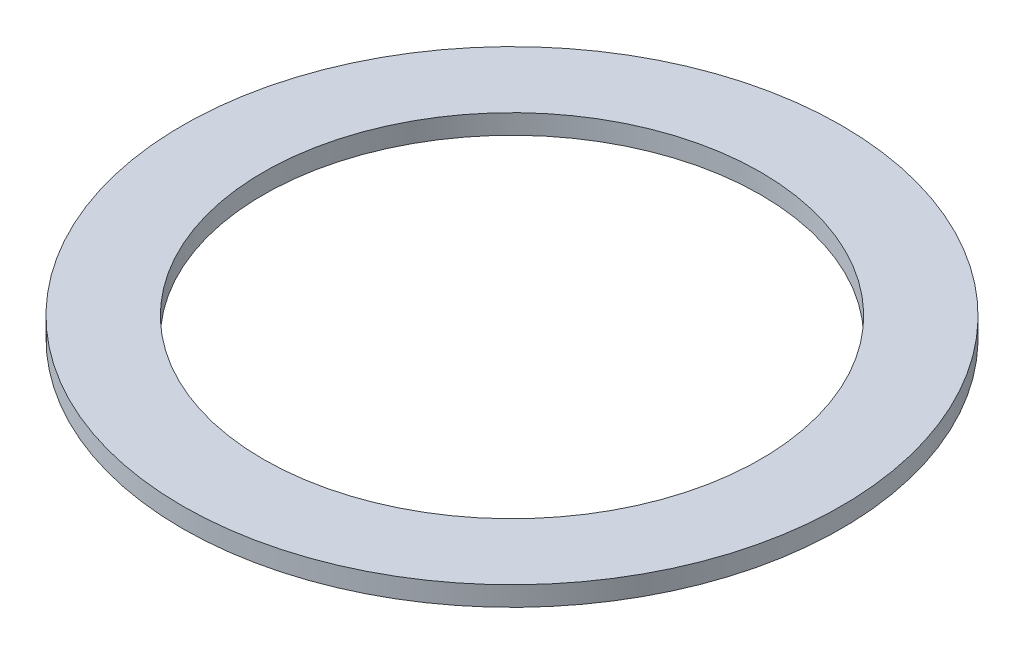
ISO-10303-21;
HEADER;
FILE_DESCRIPTION(('STEP AP214'),'2;1');
FILE_NAME('part.step','',(''),(''),'','','');
FILE_SCHEMA(('AUTOMOTIVE_DESIGN { 1 0 10303 214 1 1 1 1 }'));
ENDSEC;
DATA;
#1=APPLICATION_CONTEXT('core data for automotive mechanical design processes');
#2=APPLICATION_PROTOCOL_DEFINITION('international standard','automotive_design',2000,#1);
#3=PRODUCT_CONTEXT('',#1,'mechanical');
#4=PRODUCT('Part','Part','',(#3));
#5=PRODUCT_RELATED_PRODUCT_CATEGORY('part','',(#4));
#6=PRODUCT_DEFINITION_FORMATION('','',#4);
#7=PRODUCT_DEFINITION_CONTEXT('part definition',#1,'design');
#8=PRODUCT_DEFINITION('design','',#6,#7);
#9=PRODUCT_DEFINITION_SHAPE('','',#8);
#10=(LENGTH_UNIT() NAMED_UNIT(*) SI_UNIT(.MILLI.,.METRE.));
#11=(NAMED_UNIT(*) PLANE_ANGLE_UNIT() SI_UNIT($,.RADIAN.));
#12=(NAMED_UNIT(*) SI_UNIT($,.STERADIAN.) SOLID_ANGLE_UNIT());
#13=UNCERTAINTY_MEASURE_WITH_UNIT(LENGTH_MEASURE(1.E-05),#10,'distance_accuracy_value','');
#14=(GEOMETRIC_REPRESENTATION_CONTEXT(3) GLOBAL_UNCERTAINTY_ASSIGNED_CONTEXT((#13)) GLOBAL_UNIT_ASSIGNED_CONTEXT((#10,
#11,#12)) REPRESENTATION_CONTEXT('',''));
#15=CARTESIAN_POINT('',(0.,0.,0.));
#16=DIRECTION('',(0.,0.,1.));
#17=DIRECTION('',(1.,0.,0.));
#18=AXIS2_PLACEMENT_3D('',#15,#16,#17);
#19=CARTESIAN_POINT('',(0.,5.,0.));
#20=DIRECTION('',(0.,1.,0.));
#21=DIRECTION('',(0.,0.,1.));
#22=AXIS2_PLACEMENT_3D('',#19,#20,#21);
#23=PLANE('',#22);
#24=CARTESIAN_POINT('',(0.,5.,0.));
#25=DIRECTION('',(0.,1.,0.));
#26=DIRECTION('',(0.,0.,1.));
#27=AXIS2_PLACEMENT_3D('',#24,#25,#26);
#28=CIRCLE('',#27,84.15);
#29=CARTESIAN_POINT('',(0.,5.,84.15));
#30=VERTEX_POINT('',#29);
#31=EDGE_CURVE('E12',#30,#30,#28,.T.);
#32=ORIENTED_EDGE('',*,*,#31,.T.);
#33=EDGE_LOOP('',(#32));
#34=FACE_BOUND('',#33,.T.);
#35=CARTESIAN_POINT('',(0.,5.,0.));
#36=DIRECTION('',(0.,1.,0.));
#37=DIRECTION('',(0.,0.,1.));
#38=AXIS2_PLACEMENT_3D('',#35,#36,#37);
#39=CIRCLE('',#38,63.5);
#40=CARTESIAN_POINT('',(0.,5.,63.5));
#41=VERTEX_POINT('',#40);
#42=EDGE_CURVE('E58',#41,#41,#39,.T.);
#43=ORIENTED_EDGE('',*,*,#42,.F.);
#44=EDGE_LOOP('',(#43));
#45=FACE_BOUND('',#44,.T.);
#46=ADVANCED_FACE('F47',(#34,#45),#23,.T.);
#47=CARTESIAN_POINT('',(0.,0.,0.));
#48=DIRECTION('',(0.,1.,0.));
#49=DIRECTION('',(0.,0.,1.));
#50=AXIS2_PLACEMENT_3D('',#47,#48,#49);
#51=PLANE('',#50);
#52=CARTESIAN_POINT('',(0.,0.,0.));
#53=DIRECTION('',(0.,1.,0.));
#54=DIRECTION('',(0.,0.,1.));
#55=AXIS2_PLACEMENT_3D('',#52,#53,#54);
#56=CIRCLE('',#55,84.15);
#57=CARTESIAN_POINT('',(0.,0.,84.15));
#58=VERTEX_POINT('',#57);
#59=EDGE_CURVE('E51',#58,#58,#56,.T.);
#60=ORIENTED_EDGE('',*,*,#59,.F.);
#61=EDGE_LOOP('',(#60));
#62=FACE_BOUND('',#61,.T.);
#63=CARTESIAN_POINT('',(0.,0.,0.));
#64=DIRECTION('',(0.,1.,0.));
#65=DIRECTION('',(0.,0.,1.));
#66=AXIS2_PLACEMENT_3D('',#63,#64,#65);
#67=CIRCLE('',#66,63.5);
#68=CARTESIAN_POINT('',(0.,0.,63.5));
#69=VERTEX_POINT('',#68);
#70=EDGE_CURVE('E60',#69,#69,#67,.T.);
#71=ORIENTED_EDGE('',*,*,#70,.T.);
#72=EDGE_LOOP('',(#71));
#73=FACE_BOUND('',#72,.T.);
#74=ADVANCED_FACE('F70',(#62,#73),#51,.F.);
#75=CARTESIAN_POINT('',(0.,5.,0.));
#76=DIRECTION('',(0.,-1.,0.));
#77=DIRECTION('',(0.,0.,-1.));
#78=AXIS2_PLACEMENT_3D('',#75,#76,#77);
#79=CYLINDRICAL_SURFACE('',#78,84.15);
#80=ORIENTED_EDGE('',*,*,#31,.F.);
#81=EDGE_LOOP('',(#80));
#82=FACE_BOUND('',#81,.T.);
#83=ORIENTED_EDGE('',*,*,#59,.T.);
#84=EDGE_LOOP('',(#83));
#85=FACE_BOUND('',#84,.T.);
#86=ADVANCED_FACE('F49',(#82,#85),#79,.T.);
#87=CARTESIAN_POINT('',(0.,5.,0.));
#88=DIRECTION('',(0.,-1.,0.));
#89=DIRECTION('',(0.,0.,-1.));
#90=AXIS2_PLACEMENT_3D('',#87,#88,#89);
#91=CYLINDRICAL_SURFACE('',#90,63.5);
#92=ORIENTED_EDGE('',*,*,#42,.T.);
#93=EDGE_LOOP('',(#92));
#94=FACE_BOUND('',#93,.T.);
#95=ORIENTED_EDGE('',*,*,#70,.F.);
#96=EDGE_LOOP('',(#95));
#97=FACE_BOUND('',#96,.T.);
#98=ADVANCED_FACE('F66',(#94,#97),#91,.F.);
#99=CLOSED_SHELL('',(#46,#74,#86,#98));
#100=MANIFOLD_SOLID_BREP('B2',#99);
#101=ADVANCED_BREP_SHAPE_REPRESENTATION('',(#18,#100),#14);
#102=SHAPE_DEFINITION_REPRESENTATION(#9,#101);
ENDSEC;
END-ISO-10303-21;
